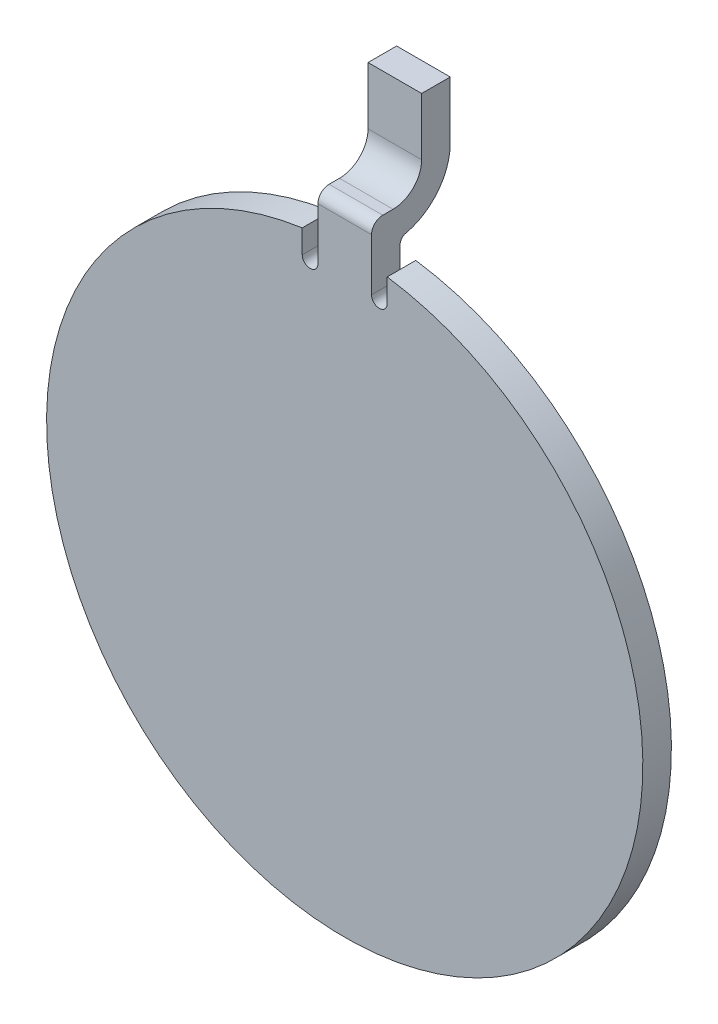
ISO-10303-21;
HEADER;
FILE_DESCRIPTION(('STEP AP214'),'2;1');
FILE_NAME('part.step','',(''),(''),'','','');
FILE_SCHEMA(('AUTOMOTIVE_DESIGN { 1 0 10303 214 1 1 1 1 }'));
ENDSEC;
DATA;
#1=APPLICATION_CONTEXT('core data for automotive mechanical design processes');
#2=APPLICATION_PROTOCOL_DEFINITION('international standard','automotive_design',2000,#1);
#3=PRODUCT_CONTEXT('',#1,'mechanical');
#4=PRODUCT('Part','Part','',(#3));
#5=PRODUCT_RELATED_PRODUCT_CATEGORY('part','',(#4));
#6=PRODUCT_DEFINITION_FORMATION('','',#4);
#7=PRODUCT_DEFINITION_CONTEXT('part definition',#1,'design');
#8=PRODUCT_DEFINITION('design','',#6,#7);
#9=PRODUCT_DEFINITION_SHAPE('','',#8);
#10=(LENGTH_UNIT() NAMED_UNIT(*) SI_UNIT(.MILLI.,.METRE.));
#11=(NAMED_UNIT(*) PLANE_ANGLE_UNIT() SI_UNIT($,.RADIAN.));
#12=(NAMED_UNIT(*) SI_UNIT($,.STERADIAN.) SOLID_ANGLE_UNIT());
#13=UNCERTAINTY_MEASURE_WITH_UNIT(LENGTH_MEASURE(1.E-05),#10,'distance_accuracy_value','');
#14=(GEOMETRIC_REPRESENTATION_CONTEXT(3) GLOBAL_UNCERTAINTY_ASSIGNED_CONTEXT((#13)) GLOBAL_UNIT_ASSIGNED_CONTEXT((#10,
#11,#12)) REPRESENTATION_CONTEXT('',''));
#15=CARTESIAN_POINT('',(0.,0.,0.));
#16=DIRECTION('',(0.,0.,1.));
#17=DIRECTION('',(1.,0.,0.));
#18=AXIS2_PLACEMENT_3D('',#15,#16,#17);
#19=CARTESIAN_POINT('',(-0.476507589397102,37.7055196206584,10.668));
#20=DIRECTION('',(0.,-1.,0.));
#21=DIRECTION('',(0.,0.,-1.));
#22=AXIS2_PLACEMENT_3D('',#19,#20,#21);
#23=PLANE('',#22);
#24=DIRECTION('',(0.,0.,1.));
#25=VECTOR('',#24,1.);
#26=CARTESIAN_POINT('',(-0.476507589397102,37.7055196206584,10.668));
#27=LINE('',#26,#25);
#28=CARTESIAN_POINT('',(-0.476507589397102,37.7055196206584,10.7928766138095));
#29=VERTEX_POINT('',#28);
#30=CARTESIAN_POINT('',(-0.476507589397102,37.7055196206584,10.976));
#31=VERTEX_POINT('',#30);
#32=EDGE_CURVE('E241',#29,#31,#27,.T.);
#33=ORIENTED_EDGE('',*,*,#32,.T.);
#34=DIRECTION('',(1.,0.,0.));
#35=VECTOR('',#34,1.);
#36=CARTESIAN_POINT('',(-0.476507589397102,37.7055196206584,10.976));
#37=LINE('',#36,#35);
#38=CARTESIAN_POINT('',(0.476507589397102,37.7055196206584,10.976));
#39=VERTEX_POINT('',#38);
#40=EDGE_CURVE('E254',#31,#39,#37,.T.);
#41=ORIENTED_EDGE('',*,*,#40,.T.);
#42=DIRECTION('',(0.,0.,1.));
#43=VECTOR('',#42,1.);
#44=CARTESIAN_POINT('',(0.476507589397102,37.7055196206584,10.668));
#45=LINE('',#44,#43);
#46=CARTESIAN_POINT('',(0.476507589397102,37.7055196206584,10.7928766138095));
#47=VERTEX_POINT('',#46);
#48=EDGE_CURVE('E236',#47,#39,#45,.T.);
#49=ORIENTED_EDGE('',*,*,#48,.F.);
#50=DIRECTION('',(-1.,0.,0.));
#51=VECTOR('',#50,1.);
#52=CARTESIAN_POINT('',(0.476507589397102,37.7055196206584,10.7928766138095));
#53=LINE('',#52,#51);
#54=EDGE_CURVE('E222',#47,#29,#53,.T.);
#55=ORIENTED_EDGE('',*,*,#54,.T.);
#56=EDGE_LOOP('',(#33,#41,#49,#55));
#57=FACE_BOUND('',#56,.T.);
#58=ADVANCED_FACE('F39',(#57),#23,.F.);
#59=CARTESIAN_POINT('',(0.,31.75,10.668));
#60=DIRECTION('',(0.,0.,-1.));
#61=DIRECTION('',(-1.,0.,0.));
#62=AXIS2_PLACEMENT_3D('',#59,#60,#61);
#63=PLANE('',#62);
#64=DIRECTION('',(0.,-1.,0.));
#65=VECTOR('',#64,1.);
#66=CARTESIAN_POINT('',(0.476507589397102,37.0276368196465,10.668));
#67=LINE('',#66,#65);
#68=CARTESIAN_POINT('',(0.476507589397102,37.0986173059169,10.668));
#69=VERTEX_POINT('',#68);
#70=CARTESIAN_POINT('',(0.476507589397102,36.5801523813832,10.668));
#71=VERTEX_POINT('',#70);
#72=EDGE_CURVE('E231',#69,#71,#67,.T.);
#73=ORIENTED_EDGE('',*,*,#72,.T.);
#74=CARTESIAN_POINT('',(0.615801998549159,36.5801523813832,10.668));
#75=DIRECTION('',(0.,0.,-1.));
#76=DIRECTION('',(1.,0.,0.));
#77=AXIS2_PLACEMENT_3D('',#74,#75,#76);
#78=CIRCLE('',#77,0.139294409152057);
#79=CARTESIAN_POINT('',(0.755096407701217,36.5801523813832,10.668));
#80=VERTEX_POINT('',#79);
#81=EDGE_CURVE('E162',#80,#71,#78,.T.);
#82=ORIENTED_EDGE('',*,*,#81,.F.);
#83=DIRECTION('',(0.,-1.,0.));
#84=VECTOR('',#83,1.);
#85=CARTESIAN_POINT('',(0.755096407701217,37.0838705948078,10.668));
#86=LINE('',#85,#84);
#87=CARTESIAN_POINT('',(0.755096407701217,36.9950299615844,10.668));
#88=VERTEX_POINT('',#87);
#89=EDGE_CURVE('E170',#88,#80,#86,.T.);
#90=ORIENTED_EDGE('',*,*,#89,.F.);
#91=CARTESIAN_POINT('',(0.,31.75,10.668));
#92=DIRECTION('',(0.,0.,-1.));
#93=DIRECTION('',(-1.,0.,0.));
#94=AXIS2_PLACEMENT_3D('',#91,#92,#93);
#95=CIRCLE('',#94,5.29910463029755);
#96=CARTESIAN_POINT('',(-0.755096407701217,36.9950299615844,10.668));
#97=VERTEX_POINT('',#96);
#98=EDGE_CURVE('E233',#88,#97,#95,.T.);
#99=ORIENTED_EDGE('',*,*,#98,.T.);
#100=DIRECTION('',(0.,1.,0.));
#101=VECTOR('',#100,1.);
#102=CARTESIAN_POINT('',(-0.755096407701217,37.0838705948078,10.668));
#103=LINE('',#102,#101);
#104=CARTESIAN_POINT('',(-0.755096407701217,36.5801523813832,10.668));
#105=VERTEX_POINT('',#104);
#106=EDGE_CURVE('E180',#105,#97,#103,.T.);
#107=ORIENTED_EDGE('',*,*,#106,.F.);
#108=CARTESIAN_POINT('',(-0.615801998549159,36.5801523813832,10.668));
#109=DIRECTION('',(0.,0.,-1.));
#110=DIRECTION('',(-1.,0.,0.));
#111=AXIS2_PLACEMENT_3D('',#108,#109,#110);
#112=CIRCLE('',#111,0.139294409152057);
#113=CARTESIAN_POINT('',(-0.476507589397102,36.5801523813832,10.668));
#114=VERTEX_POINT('',#113);
#115=EDGE_CURVE('E176',#114,#105,#112,.T.);
#116=ORIENTED_EDGE('',*,*,#115,.F.);
#117=DIRECTION('',(0.,1.,0.));
#118=VECTOR('',#117,1.);
#119=CARTESIAN_POINT('',(-0.476507589397102,37.0276368196465,10.668));
#120=LINE('',#119,#118);
#121=CARTESIAN_POINT('',(-0.476507589397102,37.0986173059169,10.668));
#122=VERTEX_POINT('',#121);
#123=EDGE_CURVE('E235',#114,#122,#120,.T.);
#124=ORIENTED_EDGE('',*,*,#123,.T.);
#125=DIRECTION('',(-1.,0.,0.));
#126=VECTOR('',#125,1.);
#127=CARTESIAN_POINT('',(0.,37.0986173059169,10.668));
#128=LINE('',#127,#126);
#129=EDGE_CURVE('E244',#122,#69,#128,.F.);
#130=ORIENTED_EDGE('',*,*,#129,.T.);
#131=EDGE_LOOP('',(#73,#82,#90,#99,#107,#116,#124,#130));
#132=FACE_BOUND('',#131,.T.);
#133=ADVANCED_FACE('F282',(#132),#63,.T.);
#134=CARTESIAN_POINT('',(0.476507589397102,37.0276368196465,10.668));
#135=DIRECTION('',(-1.,0.,0.));
#136=DIRECTION('',(0.,0.,1.));
#137=AXIS2_PLACEMENT_3D('',#134,#135,#136);
#138=PLANE('',#137);
#139=DIRECTION('',(0.,-1.,0.));
#140=VECTOR('',#139,1.);
#141=CARTESIAN_POINT('',(0.476507589397102,37.0276368196465,11.176));
#142=LINE('',#141,#140);
#143=CARTESIAN_POINT('',(0.476507589397102,37.5055196206584,11.176));
#144=VERTEX_POINT('',#143);
#145=CARTESIAN_POINT('',(0.476507589397102,36.5801523813832,11.176));
#146=VERTEX_POINT('',#145);
#147=EDGE_CURVE('E149',#144,#146,#142,.T.);
#148=ORIENTED_EDGE('',*,*,#147,.T.);
#149=DIRECTION('',(0.,0.,-1.));
#150=VECTOR('',#149,1.);
#151=CARTESIAN_POINT('',(0.476507589397102,36.5801523813832,11.176));
#152=LINE('',#151,#150);
#153=EDGE_CURVE('E152',#146,#71,#152,.T.);
#154=ORIENTED_EDGE('',*,*,#153,.T.);
#155=ORIENTED_EDGE('',*,*,#72,.F.);
#156=CARTESIAN_POINT('',(0.476507589397102,37.0986173059169,10.541));
#157=DIRECTION('',(-1.,0.,0.));
#158=DIRECTION('',(0.,0.,1.));
#159=AXIS2_PLACEMENT_3D('',#156,#157,#158);
#160=CIRCLE('',#159,0.127);
#161=CARTESIAN_POINT('',(0.476507589397102,37.2224953408882,10.5689862904233));
#162=VERTEX_POINT('',#161);
#163=EDGE_CURVE('E249',#69,#162,#160,.T.);
#164=ORIENTED_EDGE('',*,*,#163,.T.);
#165=CARTESIAN_POINT('',(0.476507589397102,38.2135196206584,10.7928766138095));
#166=DIRECTION('',(-1.,0.,0.));
#167=DIRECTION('',(0.,0.,1.));
#168=AXIS2_PLACEMENT_3D('',#165,#166,#167);
#169=CIRCLE('',#168,1.016);
#170=CARTESIAN_POINT('',(0.476507589397102,38.2135196206584,9.7768766138095));
#171=VERTEX_POINT('',#170);
#172=EDGE_CURVE('E204',#162,#171,#169,.F.);
#173=ORIENTED_EDGE('',*,*,#172,.T.);
#174=DIRECTION('',(0.,1.,0.));
#175=VECTOR('',#174,1.);
#176=CARTESIAN_POINT('',(0.476507589397102,38.2135196206584,9.7768766138095));
#177=LINE('',#176,#175);
#178=CARTESIAN_POINT('',(0.476507589397102,39.2339446156029,9.7768766138095));
#179=VERTEX_POINT('',#178);
#180=EDGE_CURVE('E202',#171,#179,#177,.T.);
#181=ORIENTED_EDGE('',*,*,#180,.T.);
#182=DIRECTION('',(0.,0.,1.));
#183=VECTOR('',#182,1.);
#184=CARTESIAN_POINT('',(0.476507589397102,39.2339446156029,9.7768766138095));
#185=LINE('',#184,#183);
#186=CARTESIAN_POINT('',(0.476507589397102,39.2339446156029,10.2848766138095));
#187=VERTEX_POINT('',#186);
#188=EDGE_CURVE('E199',#179,#187,#185,.T.);
#189=ORIENTED_EDGE('',*,*,#188,.T.);
#190=DIRECTION('',(0.,1.,0.));
#191=VECTOR('',#190,1.);
#192=CARTESIAN_POINT('',(0.476507589397102,38.2135196206584,10.2848766138095));
#193=LINE('',#192,#191);
#194=CARTESIAN_POINT('',(0.476507589397102,38.2135196206584,10.2848766138095));
#195=VERTEX_POINT('',#194);
#196=EDGE_CURVE('E196',#195,#187,#193,.T.);
#197=ORIENTED_EDGE('',*,*,#196,.F.);
#198=CARTESIAN_POINT('',(0.476507589397102,38.2135196206584,10.7928766138095));
#199=DIRECTION('',(1.,0.,0.));
#200=DIRECTION('',(0.,0.,-1.));
#201=AXIS2_PLACEMENT_3D('',#198,#199,#200);
#202=CIRCLE('',#201,0.508000000000001);
#203=EDGE_CURVE('E206',#47,#195,#202,.T.);
#204=ORIENTED_EDGE('',*,*,#203,.F.);
#205=ORIENTED_EDGE('',*,*,#48,.T.);
#206=CARTESIAN_POINT('',(0.476507589397102,37.5055196206584,10.976));
#207=DIRECTION('',(-1.,0.,0.));
#208=DIRECTION('',(0.,0.,1.));
#209=AXIS2_PLACEMENT_3D('',#206,#207,#208);
#210=CIRCLE('',#209,0.2);
#211=EDGE_CURVE('E155',#39,#144,#210,.F.);
#212=ORIENTED_EDGE('',*,*,#211,.T.);
#213=EDGE_LOOP('',(#148,#154,#155,#164,#173,#181,#189,#197,#204,#205,#212));
#214=FACE_BOUND('',#213,.T.);
#215=ADVANCED_FACE('F150',(#214),#138,.F.);
#216=CARTESIAN_POINT('',(0.,31.75,10.668));
#217=DIRECTION('',(0.,0.,1.));
#218=DIRECTION('',(1.,0.,0.));
#219=AXIS2_PLACEMENT_3D('',#216,#217,#218);
#220=CYLINDRICAL_SURFACE('',#219,5.29910463029755);
#221=ORIENTED_EDGE('',*,*,#98,.F.);
#222=DIRECTION('',(0.,0.,1.));
#223=VECTOR('',#222,1.);
#224=CARTESIAN_POINT('',(0.755096407701217,36.9950299615844,10.668));
#225=LINE('',#224,#223);
#226=CARTESIAN_POINT('',(0.755096407701217,36.9950299615844,11.176));
#227=VERTEX_POINT('',#226);
#228=EDGE_CURVE('E163',#88,#227,#225,.T.);
#229=ORIENTED_EDGE('',*,*,#228,.T.);
#230=CARTESIAN_POINT('',(0.,31.75,11.176));
#231=DIRECTION('',(0.,0.,-1.));
#232=DIRECTION('',(-1.,0.,0.));
#233=AXIS2_PLACEMENT_3D('',#230,#231,#232);
#234=CIRCLE('',#233,5.29910463029755);
#235=CARTESIAN_POINT('',(-0.755096407701217,36.9950299615844,11.176));
#236=VERTEX_POINT('',#235);
#237=EDGE_CURVE('E157',#227,#236,#234,.T.);
#238=ORIENTED_EDGE('',*,*,#237,.T.);
#239=DIRECTION('',(0.,0.,1.));
#240=VECTOR('',#239,1.);
#241=CARTESIAN_POINT('',(-0.755096407701217,36.9950299615844,10.668));
#242=LINE('',#241,#240);
#243=EDGE_CURVE('E190',#236,#97,#242,.F.);
#244=ORIENTED_EDGE('',*,*,#243,.T.);
#245=EDGE_LOOP('',(#221,#229,#238,#244));
#246=FACE_BOUND('',#245,.T.);
#247=ADVANCED_FACE('F293',(#246),#220,.T.);
#248=CARTESIAN_POINT('',(-0.476507589397102,37.0276368196465,10.668));
#249=DIRECTION('',(1.,0.,0.));
#250=DIRECTION('',(0.,0.,-1.));
#251=AXIS2_PLACEMENT_3D('',#248,#249,#250);
#252=PLANE('',#251);
#253=DIRECTION('',(0.,1.,0.));
#254=VECTOR('',#253,1.);
#255=CARTESIAN_POINT('',(-0.476507589397102,37.0276368196465,11.176));
#256=LINE('',#255,#254);
#257=CARTESIAN_POINT('',(-0.476507589397102,36.5801523813832,11.176));
#258=VERTEX_POINT('',#257);
#259=CARTESIAN_POINT('',(-0.476507589397102,37.5055196206584,11.176));
#260=VERTEX_POINT('',#259);
#261=EDGE_CURVE('E62',#258,#260,#256,.T.);
#262=ORIENTED_EDGE('',*,*,#261,.T.);
#263=CARTESIAN_POINT('',(-0.476507589397102,37.5055196206584,10.976));
#264=DIRECTION('',(1.,0.,0.));
#265=DIRECTION('',(0.,0.,-1.));
#266=AXIS2_PLACEMENT_3D('',#263,#264,#265);
#267=CIRCLE('',#266,0.2);
#268=EDGE_CURVE('E47',#260,#31,#267,.F.);
#269=ORIENTED_EDGE('',*,*,#268,.T.);
#270=ORIENTED_EDGE('',*,*,#32,.F.);
#271=CARTESIAN_POINT('',(-0.476507589397102,38.2135196206584,10.7928766138095));
#272=DIRECTION('',(1.,0.,0.));
#273=DIRECTION('',(0.,0.,-1.));
#274=AXIS2_PLACEMENT_3D('',#271,#272,#273);
#275=CIRCLE('',#274,0.508000000000001);
#276=CARTESIAN_POINT('',(-0.476507589397102,38.2135196206584,10.2848766138095));
#277=VERTEX_POINT('',#276);
#278=EDGE_CURVE('E200',#29,#277,#275,.T.);
#279=ORIENTED_EDGE('',*,*,#278,.T.);
#280=DIRECTION('',(0.,1.,0.));
#281=VECTOR('',#280,1.);
#282=CARTESIAN_POINT('',(-0.476507589397102,38.2135196206584,10.2848766138095));
#283=LINE('',#282,#281);
#284=CARTESIAN_POINT('',(-0.476507589397102,39.2339446156029,10.2848766138095));
#285=VERTEX_POINT('',#284);
#286=EDGE_CURVE('E195',#277,#285,#283,.T.);
#287=ORIENTED_EDGE('',*,*,#286,.T.);
#288=DIRECTION('',(0.,0.,1.));
#289=VECTOR('',#288,1.);
#290=CARTESIAN_POINT('',(-0.476507589397102,39.2339446156029,9.7768766138095));
#291=LINE('',#290,#289);
#292=CARTESIAN_POINT('',(-0.476507589397102,39.2339446156029,9.7768766138095));
#293=VERTEX_POINT('',#292);
#294=EDGE_CURVE('E212',#293,#285,#291,.T.);
#295=ORIENTED_EDGE('',*,*,#294,.F.);
#296=DIRECTION('',(0.,1.,0.));
#297=VECTOR('',#296,1.);
#298=CARTESIAN_POINT('',(-0.476507589397102,38.2135196206584,9.7768766138095));
#299=LINE('',#298,#297);
#300=CARTESIAN_POINT('',(-0.476507589397102,38.2135196206584,9.7768766138095));
#301=VERTEX_POINT('',#300);
#302=EDGE_CURVE('E215',#301,#293,#299,.T.);
#303=ORIENTED_EDGE('',*,*,#302,.F.);
#304=CARTESIAN_POINT('',(-0.476507589397102,38.2135196206584,10.7928766138095));
#305=DIRECTION('',(-1.,0.,0.));
#306=DIRECTION('',(0.,0.,1.));
#307=AXIS2_PLACEMENT_3D('',#304,#305,#306);
#308=CIRCLE('',#307,1.016);
#309=CARTESIAN_POINT('',(-0.476507589397102,37.2224953408882,10.5689862904233));
#310=VERTEX_POINT('',#309);
#311=EDGE_CURVE('E217',#310,#301,#308,.F.);
#312=ORIENTED_EDGE('',*,*,#311,.F.);
#313=CARTESIAN_POINT('',(-0.476507589397102,37.0986173059169,10.541));
#314=DIRECTION('',(1.,0.,0.));
#315=DIRECTION('',(0.,0.,-1.));
#316=AXIS2_PLACEMENT_3D('',#313,#314,#315);
#317=CIRCLE('',#316,0.127);
#318=EDGE_CURVE('E251',#310,#122,#317,.T.);
#319=ORIENTED_EDGE('',*,*,#318,.T.);
#320=ORIENTED_EDGE('',*,*,#123,.F.);
#321=DIRECTION('',(0.,0.,-1.));
#322=VECTOR('',#321,1.);
#323=CARTESIAN_POINT('',(-0.476507589397102,36.5801523813832,11.176));
#324=LINE('',#323,#322);
#325=EDGE_CURVE('E183',#258,#114,#324,.T.);
#326=ORIENTED_EDGE('',*,*,#325,.F.);
#327=EDGE_LOOP('',(#262,#269,#270,#279,#287,#295,#303,#312,#319,#320,#326));
#328=FACE_BOUND('',#327,.T.);
#329=ADVANCED_FACE('F262',(#328),#252,.F.);
#330=CARTESIAN_POINT('',(0.,31.75,11.176));
#331=DIRECTION('',(0.,0.,-1.));
#332=DIRECTION('',(-1.,0.,0.));
#333=AXIS2_PLACEMENT_3D('',#330,#331,#332);
#334=PLANE('',#333);
#335=CARTESIAN_POINT('',(0.615801998549159,36.5801523813832,11.176));
#336=DIRECTION('',(0.,0.,-1.));
#337=DIRECTION('',(1.,0.,0.));
#338=AXIS2_PLACEMENT_3D('',#335,#336,#337);
#339=CIRCLE('',#338,0.139294409152057);
#340=CARTESIAN_POINT('',(0.755096407701217,36.5801523813832,11.176));
#341=VERTEX_POINT('',#340);
#342=EDGE_CURVE('E54',#341,#146,#339,.T.);
#343=ORIENTED_EDGE('',*,*,#342,.T.);
#344=ORIENTED_EDGE('',*,*,#147,.F.);
#345=DIRECTION('',(1.,0.,0.));
#346=VECTOR('',#345,1.);
#347=CARTESIAN_POINT('',(0.,37.5055196206584,11.176));
#348=LINE('',#347,#346);
#349=EDGE_CURVE('E258',#144,#260,#348,.F.);
#350=ORIENTED_EDGE('',*,*,#349,.T.);
#351=ORIENTED_EDGE('',*,*,#261,.F.);
#352=CARTESIAN_POINT('',(-0.615801998549159,36.5801523813832,11.176));
#353=DIRECTION('',(0.,0.,-1.));
#354=DIRECTION('',(-1.,0.,0.));
#355=AXIS2_PLACEMENT_3D('',#352,#353,#354);
#356=CIRCLE('',#355,0.139294409152057);
#357=CARTESIAN_POINT('',(-0.755096407701217,36.5801523813832,11.176));
#358=VERTEX_POINT('',#357);
#359=EDGE_CURVE('E177',#258,#358,#356,.T.);
#360=ORIENTED_EDGE('',*,*,#359,.T.);
#361=DIRECTION('',(0.,1.,0.));
#362=VECTOR('',#361,1.);
#363=CARTESIAN_POINT('',(-0.755096407701217,37.0838705948078,11.176));
#364=LINE('',#363,#362);
#365=EDGE_CURVE('E179',#358,#236,#364,.T.);
#366=ORIENTED_EDGE('',*,*,#365,.T.);
#367=ORIENTED_EDGE('',*,*,#237,.F.);
#368=DIRECTION('',(0.,-1.,0.));
#369=VECTOR('',#368,1.);
#370=CARTESIAN_POINT('',(0.755096407701215,31.75,11.176));
#371=LINE('',#370,#369);
#372=EDGE_CURVE('E11',#227,#341,#371,.T.);
#373=ORIENTED_EDGE('',*,*,#372,.T.);
#374=EDGE_LOOP('',(#343,#344,#350,#351,#360,#366,#367,#373));
#375=FACE_BOUND('',#374,.T.);
#376=ADVANCED_FACE('F166',(#375),#334,.F.);
#377=CARTESIAN_POINT('',(0.476507589397102,38.2135196206584,10.2848766138095));
#378=DIRECTION('',(0.,0.,1.));
#379=DIRECTION('',(1.,0.,0.));
#380=AXIS2_PLACEMENT_3D('',#377,#378,#379);
#381=PLANE('',#380);
#382=ORIENTED_EDGE('',*,*,#286,.F.);
#383=DIRECTION('',(-1.,0.,0.));
#384=VECTOR('',#383,1.);
#385=CARTESIAN_POINT('',(0.476507589397102,38.2135196206584,10.2848766138095));
#386=LINE('',#385,#384);
#387=EDGE_CURVE('E158',#195,#277,#386,.T.);
#388=ORIENTED_EDGE('',*,*,#387,.F.);
#389=ORIENTED_EDGE('',*,*,#196,.T.);
#390=DIRECTION('',(-1.,0.,0.));
#391=VECTOR('',#390,1.);
#392=CARTESIAN_POINT('',(0.476507589397102,39.2339446156029,10.2848766138095));
#393=LINE('',#392,#391);
#394=EDGE_CURVE('E209',#187,#285,#393,.T.);
#395=ORIENTED_EDGE('',*,*,#394,.T.);
#396=EDGE_LOOP('',(#382,#388,#389,#395));
#397=FACE_BOUND('',#396,.T.);
#398=ADVANCED_FACE('F321',(#397),#381,.T.);
#399=CARTESIAN_POINT('',(0.476507589397102,38.2135196206584,10.7928766138095));
#400=DIRECTION('',(-1.,0.,0.));
#401=DIRECTION('',(0.,0.,1.));
#402=AXIS2_PLACEMENT_3D('',#399,#400,#401);
#403=CYLINDRICAL_SURFACE('',#402,0.508000000000001);
#404=ORIENTED_EDGE('',*,*,#278,.F.);
#405=ORIENTED_EDGE('',*,*,#54,.F.);
#406=ORIENTED_EDGE('',*,*,#203,.T.);
#407=ORIENTED_EDGE('',*,*,#387,.T.);
#408=EDGE_LOOP('',(#404,#405,#406,#407));
#409=FACE_BOUND('',#408,.T.);
#410=ADVANCED_FACE('F327',(#409),#403,.F.);
#411=CARTESIAN_POINT('',(0.476507589397102,38.2135196206584,10.7928766138095));
#412=DIRECTION('',(-1.,0.,0.));
#413=DIRECTION('',(0.,0.,1.));
#414=AXIS2_PLACEMENT_3D('',#411,#412,#413);
#415=CYLINDRICAL_SURFACE('',#414,1.016);
#416=ORIENTED_EDGE('',*,*,#172,.F.);
#417=DIRECTION('',(-1.,0.,0.));
#418=VECTOR('',#417,1.);
#419=CARTESIAN_POINT('',(0.476507589397102,37.2224953408882,10.5689862904233));
#420=LINE('',#419,#418);
#421=EDGE_CURVE('E247',#162,#310,#420,.T.);
#422=ORIENTED_EDGE('',*,*,#421,.T.);
#423=ORIENTED_EDGE('',*,*,#311,.T.);
#424=DIRECTION('',(-1.,0.,0.));
#425=VECTOR('',#424,1.);
#426=CARTESIAN_POINT('',(0.476507589397102,38.2135196206584,9.7768766138095));
#427=LINE('',#426,#425);
#428=EDGE_CURVE('E224',#171,#301,#427,.T.);
#429=ORIENTED_EDGE('',*,*,#428,.F.);
#430=EDGE_LOOP('',(#416,#422,#423,#429));
#431=FACE_BOUND('',#430,.T.);
#432=ADVANCED_FACE('F335',(#431),#415,.T.);
#433=CARTESIAN_POINT('',(0.476507589397102,38.2135196206584,9.7768766138095));
#434=DIRECTION('',(0.,0.,1.));
#435=DIRECTION('',(1.,0.,0.));
#436=AXIS2_PLACEMENT_3D('',#433,#434,#435);
#437=PLANE('',#436);
#438=ORIENTED_EDGE('',*,*,#302,.T.);
#439=DIRECTION('',(-1.,0.,0.));
#440=VECTOR('',#439,1.);
#441=CARTESIAN_POINT('',(0.476507589397102,39.2339446156029,9.7768766138095));
#442=LINE('',#441,#440);
#443=EDGE_CURVE('E227',#179,#293,#442,.T.);
#444=ORIENTED_EDGE('',*,*,#443,.F.);
#445=ORIENTED_EDGE('',*,*,#180,.F.);
#446=ORIENTED_EDGE('',*,*,#428,.T.);
#447=EDGE_LOOP('',(#438,#444,#445,#446));
#448=FACE_BOUND('',#447,.T.);
#449=ADVANCED_FACE('F343',(#448),#437,.F.);
#450=CARTESIAN_POINT('',(0.476507589397102,39.2339446156029,9.7768766138095));
#451=DIRECTION('',(0.,-1.,0.));
#452=DIRECTION('',(0.,0.,-1.));
#453=AXIS2_PLACEMENT_3D('',#450,#451,#452);
#454=PLANE('',#453);
#455=ORIENTED_EDGE('',*,*,#294,.T.);
#456=ORIENTED_EDGE('',*,*,#394,.F.);
#457=ORIENTED_EDGE('',*,*,#188,.F.);
#458=ORIENTED_EDGE('',*,*,#443,.T.);
#459=EDGE_LOOP('',(#455,#456,#457,#458));
#460=FACE_BOUND('',#459,.T.);
#461=ADVANCED_FACE('F279',(#460),#454,.F.);
#462=CARTESIAN_POINT('',(0.476507589397102,37.0986173059169,10.541));
#463=DIRECTION('',(-1.,0.,0.));
#464=DIRECTION('',(0.,0.,1.));
#465=AXIS2_PLACEMENT_3D('',#462,#463,#464);
#466=CYLINDRICAL_SURFACE('',#465,0.127);
#467=ORIENTED_EDGE('',*,*,#318,.F.);
#468=ORIENTED_EDGE('',*,*,#421,.F.);
#469=ORIENTED_EDGE('',*,*,#163,.F.);
#470=ORIENTED_EDGE('',*,*,#129,.F.);
#471=EDGE_LOOP('',(#467,#468,#469,#470));
#472=FACE_BOUND('',#471,.T.);
#473=ADVANCED_FACE('F271',(#472),#466,.F.);
#474=CARTESIAN_POINT('',(-0.476507589397102,37.5055196206584,10.976));
#475=DIRECTION('',(1.,0.,0.));
#476=DIRECTION('',(0.,0.,-1.));
#477=AXIS2_PLACEMENT_3D('',#474,#475,#476);
#478=CYLINDRICAL_SURFACE('',#477,0.2);
#479=ORIENTED_EDGE('',*,*,#268,.F.);
#480=ORIENTED_EDGE('',*,*,#349,.F.);
#481=ORIENTED_EDGE('',*,*,#211,.F.);
#482=ORIENTED_EDGE('',*,*,#40,.F.);
#483=EDGE_LOOP('',(#479,#480,#481,#482));
#484=FACE_BOUND('',#483,.T.);
#485=ADVANCED_FACE('F41',(#484),#478,.T.);
#486=CARTESIAN_POINT('',(-0.755096407701217,37.0838705948078,11.176));
#487=DIRECTION('',(-1.,0.,0.));
#488=DIRECTION('',(0.,-1.,0.));
#489=AXIS2_PLACEMENT_3D('',#486,#487,#488);
#490=PLANE('',#489);
#491=ORIENTED_EDGE('',*,*,#365,.F.);
#492=DIRECTION('',(0.,0.,-1.));
#493=VECTOR('',#492,1.);
#494=CARTESIAN_POINT('',(-0.755096407701217,36.5801523813832,11.176));
#495=LINE('',#494,#493);
#496=EDGE_CURVE('E188',#358,#105,#495,.T.);
#497=ORIENTED_EDGE('',*,*,#496,.T.);
#498=ORIENTED_EDGE('',*,*,#106,.T.);
#499=ORIENTED_EDGE('',*,*,#243,.F.);
#500=EDGE_LOOP('',(#491,#497,#498,#499));
#501=FACE_BOUND('',#500,.T.);
#502=ADVANCED_FACE('F270',(#501),#490,.F.);
#503=CARTESIAN_POINT('',(-0.615801998549159,36.5801523813832,11.176));
#504=DIRECTION('',(0.,0.,-1.));
#505=DIRECTION('',(-1.,0.,0.));
#506=AXIS2_PLACEMENT_3D('',#503,#504,#505);
#507=CYLINDRICAL_SURFACE('',#506,0.139294409152057);
#508=ORIENTED_EDGE('',*,*,#115,.T.);
#509=ORIENTED_EDGE('',*,*,#496,.F.);
#510=ORIENTED_EDGE('',*,*,#359,.F.);
#511=ORIENTED_EDGE('',*,*,#325,.T.);
#512=EDGE_LOOP('',(#508,#509,#510,#511));
#513=FACE_BOUND('',#512,.T.);
#514=ADVANCED_FACE('F276',(#513),#507,.F.);
#515=CARTESIAN_POINT('',(0.755096407701217,37.0838705948078,11.176));
#516=DIRECTION('',(1.,0.,0.));
#517=DIRECTION('',(0.,1.,0.));
#518=AXIS2_PLACEMENT_3D('',#515,#516,#517);
#519=PLANE('',#518);
#520=ORIENTED_EDGE('',*,*,#89,.T.);
#521=DIRECTION('',(0.,0.,-1.));
#522=VECTOR('',#521,1.);
#523=CARTESIAN_POINT('',(0.755096407701217,36.5801523813832,11.176));
#524=LINE('',#523,#522);
#525=EDGE_CURVE('E164',#341,#80,#524,.T.);
#526=ORIENTED_EDGE('',*,*,#525,.F.);
#527=ORIENTED_EDGE('',*,*,#372,.F.);
#528=ORIENTED_EDGE('',*,*,#228,.F.);
#529=EDGE_LOOP('',(#520,#526,#527,#528));
#530=FACE_BOUND('',#529,.T.);
#531=ADVANCED_FACE('F369',(#530),#519,.F.);
#532=CARTESIAN_POINT('',(0.615801998549159,36.5801523813832,11.176));
#533=DIRECTION('',(0.,0.,-1.));
#534=DIRECTION('',(-1.,0.,0.));
#535=AXIS2_PLACEMENT_3D('',#532,#533,#534);
#536=CYLINDRICAL_SURFACE('',#535,0.139294409152057);
#537=ORIENTED_EDGE('',*,*,#81,.T.);
#538=ORIENTED_EDGE('',*,*,#153,.F.);
#539=ORIENTED_EDGE('',*,*,#342,.F.);
#540=ORIENTED_EDGE('',*,*,#525,.T.);
#541=EDGE_LOOP('',(#537,#538,#539,#540));
#542=FACE_BOUND('',#541,.T.);
#543=ADVANCED_FACE('F160',(#542),#536,.F.);
#544=CLOSED_SHELL('',(#58,#133,#215,#247,#329,#376,#398,#410,#432,#449,#461,#473,#485,#502,#514,
#531,#543));
#545=MANIFOLD_SOLID_BREP('B2',#544);
#546=ADVANCED_BREP_SHAPE_REPRESENTATION('',(#18,#545),#14);
#547=SHAPE_DEFINITION_REPRESENTATION(#9,#546);
ENDSEC;
END-ISO-10303-21;
